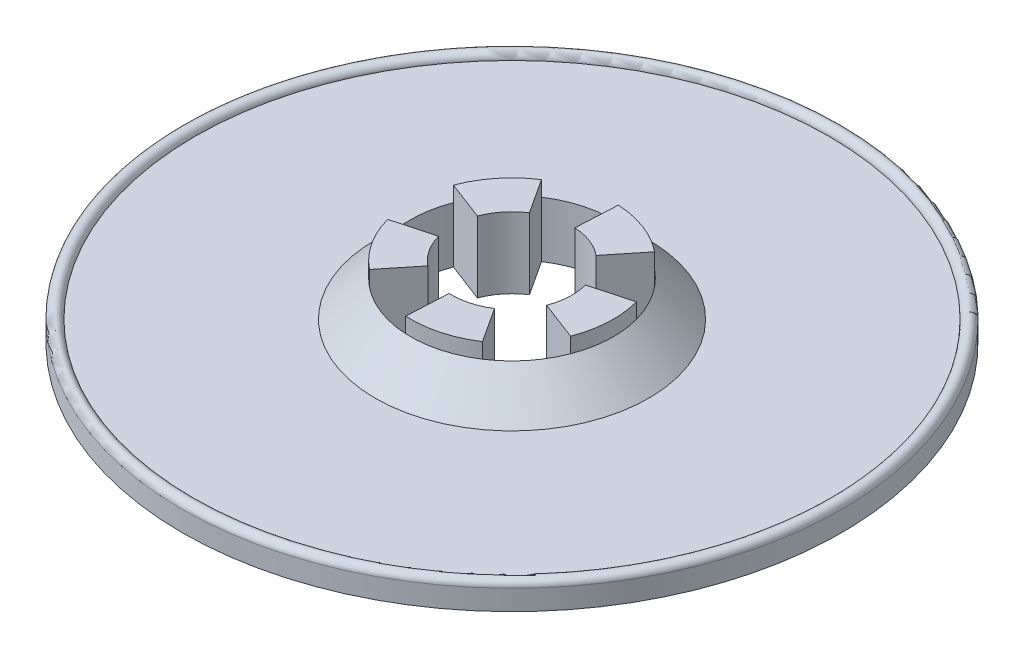
ISO-10303-21;
HEADER;
FILE_DESCRIPTION(('STEP AP214'),'2;1');
FILE_NAME('part.step','',(''),(''),'','','');
FILE_SCHEMA(('AUTOMOTIVE_DESIGN { 1 0 10303 214 1 1 1 1 }'));
ENDSEC;
DATA;
#1=APPLICATION_CONTEXT('core data for automotive mechanical design processes');
#2=APPLICATION_PROTOCOL_DEFINITION('international standard','automotive_design',2000,#1);
#3=PRODUCT_CONTEXT('',#1,'mechanical');
#4=PRODUCT('Part','Part','',(#3));
#5=PRODUCT_RELATED_PRODUCT_CATEGORY('part','',(#4));
#6=PRODUCT_DEFINITION_FORMATION('','',#4);
#7=PRODUCT_DEFINITION_CONTEXT('part definition',#1,'design');
#8=PRODUCT_DEFINITION('design','',#6,#7);
#9=PRODUCT_DEFINITION_SHAPE('','',#8);
#10=(LENGTH_UNIT() NAMED_UNIT(*) SI_UNIT(.MILLI.,.METRE.));
#11=(NAMED_UNIT(*) PLANE_ANGLE_UNIT() SI_UNIT($,.RADIAN.));
#12=(NAMED_UNIT(*) SI_UNIT($,.STERADIAN.) SOLID_ANGLE_UNIT());
#13=UNCERTAINTY_MEASURE_WITH_UNIT(LENGTH_MEASURE(1.E-05),#10,'distance_accuracy_value','');
#14=(GEOMETRIC_REPRESENTATION_CONTEXT(3) GLOBAL_UNCERTAINTY_ASSIGNED_CONTEXT((#13)) GLOBAL_UNIT_ASSIGNED_CONTEXT((#10,
#11,#12)) REPRESENTATION_CONTEXT('',''));
#15=CARTESIAN_POINT('',(0.,0.,0.));
#16=DIRECTION('',(0.,0.,1.));
#17=DIRECTION('',(1.,0.,0.));
#18=AXIS2_PLACEMENT_3D('',#15,#16,#17);
#19=CARTESIAN_POINT('',(0.,2.54,0.));
#20=DIRECTION('',(0.,1.,0.));
#21=DIRECTION('',(0.,0.,1.));
#22=AXIS2_PLACEMENT_3D('',#19,#20,#21);
#23=PLANE('',#22);
#24=CARTESIAN_POINT('',(0.,2.54,0.));
#25=DIRECTION('',(0.,1.,0.));
#26=DIRECTION('',(0.,0.,1.));
#27=AXIS2_PLACEMENT_3D('',#24,#25,#26);
#28=CIRCLE('',#27,17.145);
#29=CARTESIAN_POINT('',(0.,2.54,17.145));
#30=VERTEX_POINT('',#29);
#31=EDGE_CURVE('E52',#30,#30,#28,.F.);
#32=ORIENTED_EDGE('',*,*,#31,.T.);
#33=EDGE_LOOP('',(#32));
#34=FACE_BOUND('',#33,.T.);
#35=CARTESIAN_POINT('',(0.,2.54,0.));
#36=DIRECTION('',(0.,-1.,0.));
#37=DIRECTION('',(0.,0.,-1.));
#38=AXIS2_PLACEMENT_3D('',#35,#36,#37);
#39=CIRCLE('',#38,39.68496);
#40=CARTESIAN_POINT('',(0.,2.54,-39.68496));
#41=VERTEX_POINT('',#40);
#42=EDGE_CURVE('E11',#41,#41,#39,.T.);
#43=ORIENTED_EDGE('',*,*,#42,.F.);
#44=EDGE_LOOP('',(#43));
#45=FACE_BOUND('',#44,.T.);
#46=ADVANCED_FACE('F42',(#34,#45),#23,.T.);
#47=CARTESIAN_POINT('',(0.,8.89,0.));
#48=DIRECTION('',(0.,-1.,0.));
#49=DIRECTION('',(0.,0.,-1.));
#50=AXIS2_PLACEMENT_3D('',#47,#48,#49);
#51=CYLINDRICAL_SURFACE('',#50,12.7);
#52=DIRECTION('',(0.,-1.,0.));
#53=VECTOR('',#52,1.);
#54=CARTESIAN_POINT('',(-0.637603684295905,8.89,12.683984450549));
#55=LINE('',#54,#53);
#56=CARTESIAN_POINT('',(-0.637603684295905,8.89,12.683984450549));
#57=VERTEX_POINT('',#56);
#58=CARTESIAN_POINT('',(-0.637603684295905,6.98500000000022,12.683984450549));
#59=VERTEX_POINT('',#58);
#60=EDGE_CURVE('E391',#57,#59,#55,.T.);
#61=ORIENTED_EDGE('',*,*,#60,.T.);
#62=CARTESIAN_POINT('',(0.,6.98500000000003,0.));
#63=DIRECTION('',(0.,1.,0.));
#64=DIRECTION('',(0.,0.,1.));
#65=AXIS2_PLACEMENT_3D('',#62,#63,#64);
#66=CIRCLE('',#65,12.7);
#67=CARTESIAN_POINT('',(6.93962678406843,6.98499999999977,10.6363330193185));
#68=VERTEX_POINT('',#67);
#69=EDGE_CURVE('E468',#59,#68,#66,.T.);
#70=ORIENTED_EDGE('',*,*,#69,.T.);
#71=DIRECTION('',(0.,-1.,0.));
#72=VECTOR('',#71,1.);
#73=CARTESIAN_POINT('',(6.93962678406843,8.89,10.6363330193185));
#74=LINE('',#73,#72);
#75=CARTESIAN_POINT('',(6.93962678406843,8.89,10.6363330193185));
#76=VERTEX_POINT('',#75);
#77=EDGE_CURVE('E402',#76,#68,#74,.T.);
#78=ORIENTED_EDGE('',*,*,#77,.F.);
#79=CARTESIAN_POINT('',(0.,8.89,0.));
#80=DIRECTION('',(0.,1.,0.));
#81=DIRECTION('',(0.,0.,1.));
#82=AXIS2_PLACEMENT_3D('',#79,#80,#81);
#83=CIRCLE('',#82,12.7);
#84=EDGE_CURVE('E389',#57,#76,#83,.T.);
#85=ORIENTED_EDGE('',*,*,#84,.F.);
#86=EDGE_LOOP('',(#61,#70,#78,#85));
#87=FACE_BOUND('',#86,.T.);
#88=ADVANCED_FACE('F599',(#87),#51,.T.);
#89=DIRECTION('',(0.,-1.,0.));
#90=VECTOR('',#89,1.);
#91=CARTESIAN_POINT('',(11.8661556901579,8.89,4.5259638903708));
#92=LINE('',#91,#90);
#93=CARTESIAN_POINT('',(11.8661556901579,8.89,4.5259638903708));
#94=VERTEX_POINT('',#93);
#95=CARTESIAN_POINT('',(11.8661556901579,6.98499999999977,4.5259638903708));
#96=VERTEX_POINT('',#95);
#97=EDGE_CURVE('E407',#94,#96,#92,.T.);
#98=ORIENTED_EDGE('',*,*,#97,.T.);
#99=CARTESIAN_POINT('',(12.2602164384049,6.98499999999977,-3.31316961284385));
#100=VERTEX_POINT('',#99);
#101=EDGE_CURVE('E475',#96,#100,#66,.T.);
#102=ORIENTED_EDGE('',*,*,#101,.T.);
#103=DIRECTION('',(0.,-1.,0.));
#104=VECTOR('',#103,1.);
#105=CARTESIAN_POINT('',(12.2602164384049,8.89,-3.31316961284385));
#106=LINE('',#105,#104);
#107=CARTESIAN_POINT('',(12.2602164384049,8.89,-3.31316961284385));
#108=VERTEX_POINT('',#107);
#109=EDGE_CURVE('E418',#108,#100,#106,.T.);
#110=ORIENTED_EDGE('',*,*,#109,.F.);
#111=EDGE_CURVE('E463',#94,#108,#83,.T.);
#112=ORIENTED_EDGE('',*,*,#111,.F.);
#113=EDGE_LOOP('',(#98,#102,#110,#112));
#114=FACE_BOUND('',#113,.T.);
#115=ADVANCED_FACE('F503',(#114),#51,.T.);
#116=DIRECTION('',(0.,-1.,0.));
#117=VECTOR('',#116,1.);
#118=CARTESIAN_POINT('',(7.97129121661164,8.89,-9.88678493444575));
#119=LINE('',#118,#117);
#120=CARTESIAN_POINT('',(7.97129121661164,8.89,-9.88678493444575));
#121=VERTEX_POINT('',#120);
#122=CARTESIAN_POINT('',(7.97129121661164,6.98499999999977,-9.88678493444575));
#123=VERTEX_POINT('',#122);
#124=EDGE_CURVE('E423',#121,#123,#119,.T.);
#125=ORIENTED_EDGE('',*,*,#124,.T.);
#126=CARTESIAN_POINT('',(0.637603684295973,6.98499999999994,-12.6839844505495));
#127=VERTEX_POINT('',#126);
#128=EDGE_CURVE('E539',#123,#127,#66,.T.);
#129=ORIENTED_EDGE('',*,*,#128,.T.);
#130=DIRECTION('',(0.,-1.,0.));
#131=VECTOR('',#130,1.);
#132=CARTESIAN_POINT('',(0.637603684295973,8.89,-12.6839844505495));
#133=LINE('',#132,#131);
#134=CARTESIAN_POINT('',(0.637603684295973,8.89,-12.6839844505495));
#135=VERTEX_POINT('',#134);
#136=EDGE_CURVE('E434',#135,#127,#133,.T.);
#137=ORIENTED_EDGE('',*,*,#136,.F.);
#138=EDGE_CURVE('E508',#121,#135,#83,.T.);
#139=ORIENTED_EDGE('',*,*,#138,.F.);
#140=EDGE_LOOP('',(#125,#129,#137,#139));
#141=FACE_BOUND('',#140,.T.);
#142=ADVANCED_FACE('F750',(#141),#51,.T.);
#143=DIRECTION('',(0.,-1.,0.));
#144=VECTOR('',#143,1.);
#145=CARTESIAN_POINT('',(-6.93962678406824,8.89,-10.6363330193181));
#146=LINE('',#145,#144);
#147=CARTESIAN_POINT('',(-6.93962678406824,8.89,-10.6363330193181));
#148=VERTEX_POINT('',#147);
#149=CARTESIAN_POINT('',(-6.93962678406824,6.98499999999994,-10.6363330193181));
#150=VERTEX_POINT('',#149);
#151=EDGE_CURVE('E439',#148,#150,#146,.T.);
#152=ORIENTED_EDGE('',*,*,#151,.T.);
#153=CARTESIAN_POINT('',(-11.8661556901576,6.98500000000003,-4.52596389037074));
#154=VERTEX_POINT('',#153);
#155=EDGE_CURVE('E529',#150,#154,#66,.T.);
#156=ORIENTED_EDGE('',*,*,#155,.T.);
#157=DIRECTION('',(0.,-1.,0.));
#158=VECTOR('',#157,1.);
#159=CARTESIAN_POINT('',(-11.8661556901576,8.89,-4.52596389037074));
#160=LINE('',#159,#158);
#161=CARTESIAN_POINT('',(-11.8661556901576,8.89,-4.52596389037074));
#162=VERTEX_POINT('',#161);
#163=EDGE_CURVE('E73',#162,#154,#160,.T.);
#164=ORIENTED_EDGE('',*,*,#163,.F.);
#165=EDGE_CURVE('E511',#148,#162,#83,.T.);
#166=ORIENTED_EDGE('',*,*,#165,.F.);
#167=EDGE_LOOP('',(#152,#156,#164,#166));
#168=FACE_BOUND('',#167,.T.);
#169=ADVANCED_FACE('F620',(#168),#51,.T.);
#170=CARTESIAN_POINT('',(0.,8.89,0.));
#171=DIRECTION('',(0.,1.,0.));
#172=DIRECTION('',(0.,0.,1.));
#173=AXIS2_PLACEMENT_3D('',#170,#171,#172);
#174=PLANE('',#173);
#175=CARTESIAN_POINT('',(0.,8.89,0.));
#176=DIRECTION('',(0.,-1.,0.));
#177=DIRECTION('',(0.,0.,-1.));
#178=AXIS2_PLACEMENT_3D('',#175,#176,#177);
#179=CIRCLE('',#178,7.49999999999986);
#180=CARTESIAN_POINT('',(4.09820479374102,8.89,6.28129902715633));
#181=VERTEX_POINT('',#180);
#182=CARTESIAN_POINT('',(-0.37653760883616,8.89,7.49054199835562));
#183=VERTEX_POINT('',#182);
#184=EDGE_CURVE('E281',#181,#183,#179,.T.);
#185=ORIENTED_EDGE('',*,*,#184,.T.);
#186=DIRECTION('',(0.0502050145114891,0.,-0.998738933114105));
#187=VECTOR('',#186,1.);
#188=CARTESIAN_POINT('',(0.,8.89,0.));
#189=LINE('',#188,#187);
#190=EDGE_CURVE('E270',#57,#183,#189,.T.);
#191=ORIENTED_EDGE('',*,*,#190,.F.);
#192=ORIENTED_EDGE('',*,*,#84,.T.);
#193=DIRECTION('',(-0.546427305832151,0.,-0.8375065369542));
#194=VECTOR('',#193,1.);
#195=CARTESIAN_POINT('',(0.,8.89,0.));
#196=LINE('',#195,#194);
#197=EDGE_CURVE('E320',#76,#181,#196,.T.);
#198=ORIENTED_EDGE('',*,*,#197,.T.);
#199=EDGE_LOOP('',(#185,#191,#192,#198));
#200=FACE_BOUND('',#199,.T.);
#201=ADVANCED_FACE('F596',(#200),#174,.T.);
#202=CARTESIAN_POINT('',(7.24028529827031,8.89,-1.95659622805731));
#203=VERTEX_POINT('',#202);
#204=CARTESIAN_POINT('',(7.00757225796699,8.89,2.67281332108501));
#205=VERTEX_POINT('',#204);
#206=EDGE_CURVE('E316',#203,#205,#179,.T.);
#207=ORIENTED_EDGE('',*,*,#206,.T.);
#208=DIRECTION('',(-0.934342967728948,0.,-0.356375109478007));
#209=VECTOR('',#208,1.);
#210=CARTESIAN_POINT('',(0.,8.89,0.));
#211=LINE('',#210,#209);
#212=EDGE_CURVE('E317',#94,#205,#211,.T.);
#213=ORIENTED_EDGE('',*,*,#212,.F.);
#214=ORIENTED_EDGE('',*,*,#111,.T.);
#215=DIRECTION('',(-0.965371373102731,0.,0.260879497074314));
#216=VECTOR('',#215,1.);
#217=CARTESIAN_POINT('',(0.,8.89,0.));
#218=LINE('',#217,#216);
#219=EDGE_CURVE('E312',#108,#203,#218,.T.);
#220=ORIENTED_EDGE('',*,*,#219,.T.);
#221=EDGE_LOOP('',(#207,#213,#214,#220));
#222=FACE_BOUND('',#221,.T.);
#223=ADVANCED_FACE('F766',(#222),#174,.T.);
#224=CARTESIAN_POINT('',(0.37653760883619,8.89,-7.49054199835569));
#225=VERTEX_POINT('',#224);
#226=CARTESIAN_POINT('',(4.7074554428807,8.89,-5.83865252034175));
#227=VERTEX_POINT('',#226);
#228=EDGE_CURVE('E308',#225,#227,#179,.T.);
#229=ORIENTED_EDGE('',*,*,#228,.T.);
#230=DIRECTION('',(-0.627660725717426,0.,0.778487002712232));
#231=VECTOR('',#230,1.);
#232=CARTESIAN_POINT('',(0.,8.89,0.));
#233=LINE('',#232,#231);
#234=EDGE_CURVE('E309',#121,#227,#233,.T.);
#235=ORIENTED_EDGE('',*,*,#234,.F.);
#236=ORIENTED_EDGE('',*,*,#138,.T.);
#237=DIRECTION('',(-0.0502050145114927,0.,0.998738933114105));
#238=VECTOR('',#237,1.);
#239=CARTESIAN_POINT('',(0.,8.89,0.));
#240=LINE('',#239,#238);
#241=EDGE_CURVE('E304',#135,#225,#240,.T.);
#242=ORIENTED_EDGE('',*,*,#241,.T.);
#243=EDGE_LOOP('',(#229,#235,#236,#242));
#244=FACE_BOUND('',#243,.T.);
#245=ADVANCED_FACE('F657',(#244),#174,.T.);
#246=CARTESIAN_POINT('',(-7.00757225796704,8.89,-2.67281332108506));
#247=VERTEX_POINT('',#246);
#248=CARTESIAN_POINT('',(-4.09820479374107,8.89,-6.28129902715634));
#249=VERTEX_POINT('',#248);
#250=EDGE_CURVE('E282',#247,#249,#179,.T.);
#251=ORIENTED_EDGE('',*,*,#250,.T.);
#252=DIRECTION('',(0.546427305832155,0.,0.837506536954198));
#253=VECTOR('',#252,1.);
#254=CARTESIAN_POINT('',(0.,8.89,0.));
#255=LINE('',#254,#253);
#256=EDGE_CURVE('E301',#148,#249,#255,.T.);
#257=ORIENTED_EDGE('',*,*,#256,.F.);
#258=ORIENTED_EDGE('',*,*,#165,.T.);
#259=DIRECTION('',(0.934342967728947,0.,0.356375109478011));
#260=VECTOR('',#259,1.);
#261=CARTESIAN_POINT('',(0.,8.89,0.));
#262=LINE('',#261,#260);
#263=EDGE_CURVE('E297',#162,#247,#262,.T.);
#264=ORIENTED_EDGE('',*,*,#263,.T.);
#265=EDGE_LOOP('',(#251,#257,#258,#264));
#266=FACE_BOUND('',#265,.T.);
#267=ADVANCED_FACE('F613',(#266),#174,.T.);
#268=CARTESIAN_POINT('',(0.,2.54,0.));
#269=DIRECTION('',(0.,-1.,0.));
#270=DIRECTION('',(0.,0.,-1.));
#271=AXIS2_PLACEMENT_3D('',#268,#269,#270);
#272=CYLINDRICAL_SURFACE('',#271,41.275);
#273=CARTESIAN_POINT('',(0.,2.54,0.));
#274=DIRECTION('',(0.,1.,0.));
#275=DIRECTION('',(0.,0.,1.));
#276=AXIS2_PLACEMENT_3D('',#273,#274,#275);
#277=CIRCLE('',#276,41.275);
#278=CARTESIAN_POINT('',(0.,2.54,41.275));
#279=VERTEX_POINT('',#278);
#280=EDGE_CURVE('E464',#279,#279,#277,.T.);
#281=ORIENTED_EDGE('',*,*,#280,.F.);
#282=EDGE_LOOP('',(#281));
#283=FACE_BOUND('',#282,.T.);
#284=CARTESIAN_POINT('',(0.,0.,0.));
#285=DIRECTION('',(0.,1.,0.));
#286=DIRECTION('',(0.,0.,1.));
#287=AXIS2_PLACEMENT_3D('',#284,#285,#286);
#288=CIRCLE('',#287,41.275);
#289=CARTESIAN_POINT('',(0.,0.,41.275));
#290=VERTEX_POINT('',#289);
#291=EDGE_CURVE('E469',#290,#290,#288,.T.);
#292=ORIENTED_EDGE('',*,*,#291,.T.);
#293=EDGE_LOOP('',(#292));
#294=FACE_BOUND('',#293,.T.);
#295=ADVANCED_FACE('F651',(#283,#294),#272,.T.);
#296=CARTESIAN_POINT('',(0.,0.,0.));
#297=DIRECTION('',(0.,1.,0.));
#298=DIRECTION('',(0.,0.,1.));
#299=AXIS2_PLACEMENT_3D('',#296,#297,#298);
#300=PLANE('',#299);
#301=CARTESIAN_POINT('',(0.,0.,0.));
#302=DIRECTION('',(0.,-1.,0.));
#303=DIRECTION('',(0.,0.,-1.));
#304=AXIS2_PLACEMENT_3D('',#301,#302,#303);
#305=CIRCLE('',#304,7.49999999999986);
#306=CARTESIAN_POINT('',(-4.70745544288062,0.,5.83865252034161));
#307=VERTEX_POINT('',#306);
#308=CARTESIAN_POINT('',(-7.24028529827035,0.,1.95659622805735));
#309=VERTEX_POINT('',#308);
#310=EDGE_CURVE('E328',#307,#309,#305,.T.);
#311=ORIENTED_EDGE('',*,*,#310,.F.);
#312=DIRECTION('',(0.627660725717428,0.,-0.77848700271223));
#313=VECTOR('',#312,1.);
#314=CARTESIAN_POINT('',(0.,0.,0.));
#315=LINE('',#314,#313);
#316=CARTESIAN_POINT('',(-7.97129121661116,0.,9.88678493444511));
#317=VERTEX_POINT('',#316);
#318=EDGE_CURVE('E62',#317,#307,#315,.T.);
#319=ORIENTED_EDGE('',*,*,#318,.F.);
#320=CARTESIAN_POINT('',(0.,0.,0.));
#321=DIRECTION('',(0.,-1.,0.));
#322=DIRECTION('',(0.,0.,-1.));
#323=AXIS2_PLACEMENT_3D('',#320,#321,#322);
#324=CIRCLE('',#323,12.6999999999998);
#325=CARTESIAN_POINT('',(-0.637603684295905,0.,12.683984450549));
#326=VERTEX_POINT('',#325);
#327=EDGE_CURVE('E288',#326,#317,#324,.T.);
#328=ORIENTED_EDGE('',*,*,#327,.F.);
#329=DIRECTION('',(0.0502050145114891,0.,-0.998738933114105));
#330=VECTOR('',#329,1.);
#331=CARTESIAN_POINT('',(0.,0.,0.));
#332=LINE('',#331,#330);
#333=CARTESIAN_POINT('',(-0.37653760883616,0.,7.49054199835562));
#334=VERTEX_POINT('',#333);
#335=EDGE_CURVE('E292',#326,#334,#332,.T.);
#336=ORIENTED_EDGE('',*,*,#335,.T.);
#337=CARTESIAN_POINT('',(4.09820479374102,0.,6.28129902715633));
#338=VERTEX_POINT('',#337);
#339=EDGE_CURVE('E332',#338,#334,#305,.T.);
#340=ORIENTED_EDGE('',*,*,#339,.F.);
#341=DIRECTION('',(-0.546427305832151,0.,-0.8375065369542));
#342=VECTOR('',#341,1.);
#343=CARTESIAN_POINT('',(0.,0.,0.));
#344=LINE('',#343,#342);
#345=CARTESIAN_POINT('',(6.93962678406843,0.,10.6363330193185));
#346=VERTEX_POINT('',#345);
#347=EDGE_CURVE('E379',#346,#338,#344,.T.);
#348=ORIENTED_EDGE('',*,*,#347,.F.);
#349=CARTESIAN_POINT('',(0.,0.,0.));
#350=DIRECTION('',(0.,-1.,0.));
#351=DIRECTION('',(0.,0.,-1.));
#352=AXIS2_PLACEMENT_3D('',#349,#350,#351);
#353=CIRCLE('',#352,12.7000000000003);
#354=CARTESIAN_POINT('',(11.8661556901579,0.,4.5259638903708));
#355=VERTEX_POINT('',#354);
#356=EDGE_CURVE('E375',#355,#346,#353,.T.);
#357=ORIENTED_EDGE('',*,*,#356,.F.);
#358=DIRECTION('',(-0.934342967728948,0.,-0.356375109478007));
#359=VECTOR('',#358,1.);
#360=CARTESIAN_POINT('',(0.,0.,0.));
#361=LINE('',#360,#359);
#362=CARTESIAN_POINT('',(7.00757225796699,0.,2.67281332108501));
#363=VERTEX_POINT('',#362);
#364=EDGE_CURVE('E371',#355,#363,#361,.T.);
#365=ORIENTED_EDGE('',*,*,#364,.T.);
#366=CARTESIAN_POINT('',(7.24028529827031,0.,-1.95659622805731));
#367=VERTEX_POINT('',#366);
#368=EDGE_CURVE('E370',#367,#363,#305,.T.);
#369=ORIENTED_EDGE('',*,*,#368,.F.);
#370=DIRECTION('',(-0.965371373102731,0.,0.260879497074314));
#371=VECTOR('',#370,1.);
#372=CARTESIAN_POINT('',(0.,0.,0.));
#373=LINE('',#372,#371);
#374=CARTESIAN_POINT('',(12.2602164384049,0.,-3.31316961284385));
#375=VERTEX_POINT('',#374);
#376=EDGE_CURVE('E366',#375,#367,#373,.T.);
#377=ORIENTED_EDGE('',*,*,#376,.F.);
#378=CARTESIAN_POINT('',(0.,0.,0.));
#379=DIRECTION('',(0.,-1.,0.));
#380=DIRECTION('',(0.,0.,-1.));
#381=AXIS2_PLACEMENT_3D('',#378,#379,#380);
#382=CIRCLE('',#381,12.7000000000003);
#383=CARTESIAN_POINT('',(7.97129121661164,0.,-9.88678493444575));
#384=VERTEX_POINT('',#383);
#385=EDGE_CURVE('E362',#384,#375,#382,.T.);
#386=ORIENTED_EDGE('',*,*,#385,.F.);
#387=DIRECTION('',(-0.627660725717426,0.,0.778487002712232));
#388=VECTOR('',#387,1.);
#389=CARTESIAN_POINT('',(0.,0.,0.));
#390=LINE('',#389,#388);
#391=CARTESIAN_POINT('',(4.7074554428807,0.,-5.83865252034175));
#392=VERTEX_POINT('',#391);
#393=EDGE_CURVE('E358',#384,#392,#390,.T.);
#394=ORIENTED_EDGE('',*,*,#393,.T.);
#395=CARTESIAN_POINT('',(0.37653760883619,0.,-7.49054199835569));
#396=VERTEX_POINT('',#395);
#397=EDGE_CURVE('E357',#396,#392,#305,.T.);
#398=ORIENTED_EDGE('',*,*,#397,.F.);
#399=DIRECTION('',(-0.0502050145114927,0.,0.998738933114105));
#400=VECTOR('',#399,1.);
#401=CARTESIAN_POINT('',(0.,0.,0.));
#402=LINE('',#401,#400);
#403=CARTESIAN_POINT('',(0.637603684295973,0.,-12.6839844505495));
#404=VERTEX_POINT('',#403);
#405=EDGE_CURVE('E353',#404,#396,#402,.T.);
#406=ORIENTED_EDGE('',*,*,#405,.F.);
#407=CARTESIAN_POINT('',(0.,0.,0.));
#408=DIRECTION('',(0.,-1.,0.));
#409=DIRECTION('',(0.,0.,-1.));
#410=AXIS2_PLACEMENT_3D('',#407,#408,#409);
#411=CIRCLE('',#410,12.7000000000001);
#412=CARTESIAN_POINT('',(-6.93962678406824,0.,-10.6363330193181));
#413=VERTEX_POINT('',#412);
#414=EDGE_CURVE('E349',#413,#404,#411,.T.);
#415=ORIENTED_EDGE('',*,*,#414,.F.);
#416=DIRECTION('',(0.546427305832155,0.,0.837506536954198));
#417=VECTOR('',#416,1.);
#418=CARTESIAN_POINT('',(0.,0.,0.));
#419=LINE('',#418,#417);
#420=CARTESIAN_POINT('',(-4.09820479374107,0.,-6.28129902715634));
#421=VERTEX_POINT('',#420);
#422=EDGE_CURVE('E345',#413,#421,#419,.T.);
#423=ORIENTED_EDGE('',*,*,#422,.T.);
#424=CARTESIAN_POINT('',(-7.00757225796704,0.,-2.67281332108506));
#425=VERTEX_POINT('',#424);
#426=EDGE_CURVE('E333',#425,#421,#305,.T.);
#427=ORIENTED_EDGE('',*,*,#426,.F.);
#428=DIRECTION('',(0.934342967728947,0.,0.356375109478011));
#429=VECTOR('',#428,1.);
#430=CARTESIAN_POINT('',(0.,0.,0.));
#431=LINE('',#430,#429);
#432=CARTESIAN_POINT('',(-11.8661556901576,0.,-4.52596389037074));
#433=VERTEX_POINT('',#432);
#434=EDGE_CURVE('E341',#433,#425,#431,.T.);
#435=ORIENTED_EDGE('',*,*,#434,.F.);
#436=CARTESIAN_POINT('',(0.,0.,0.));
#437=DIRECTION('',(0.,-1.,0.));
#438=DIRECTION('',(0.,0.,-1.));
#439=AXIS2_PLACEMENT_3D('',#436,#437,#438);
#440=CIRCLE('',#439,12.6999999999999);
#441=CARTESIAN_POINT('',(-12.2602164384045,0.,3.3131696128438));
#442=VERTEX_POINT('',#441);
#443=EDGE_CURVE('E337',#442,#433,#440,.T.);
#444=ORIENTED_EDGE('',*,*,#443,.F.);
#445=DIRECTION('',(0.96537137310273,0.,-0.260879497074318));
#446=VECTOR('',#445,1.);
#447=CARTESIAN_POINT('',(0.,0.,0.));
#448=LINE('',#447,#446);
#449=EDGE_CURVE('E331',#442,#309,#448,.T.);
#450=ORIENTED_EDGE('',*,*,#449,.T.);
#451=EDGE_LOOP('',(#311,#319,#328,#336,#340,#348,#357,#365,#369,#377,#386,#394,#398,#406,#415,
#423,#427,#435,#444,#450));
#452=FACE_BOUND('',#451,.T.);
#453=ORIENTED_EDGE('',*,*,#291,.F.);
#454=EDGE_LOOP('',(#453));
#455=FACE_BOUND('',#454,.T.);
#456=ADVANCED_FACE('F563',(#452,#455),#300,.F.);
#457=CARTESIAN_POINT('',(-12.2602164384045,6.98500000000012,3.3131696128438));
#458=VERTEX_POINT('',#457);
#459=CARTESIAN_POINT('',(-7.97129121661116,6.98500000000022,9.88678493444511));
#460=VERTEX_POINT('',#459);
#461=EDGE_CURVE('E523',#458,#460,#66,.T.);
#462=ORIENTED_EDGE('',*,*,#461,.T.);
#463=DIRECTION('',(0.,-1.,0.));
#464=VECTOR('',#463,1.);
#465=CARTESIAN_POINT('',(-7.97129121661116,8.89,9.88678493444511));
#466=LINE('',#465,#464);
#467=CARTESIAN_POINT('',(-7.97129121661116,8.89,9.88678493444511));
#468=VERTEX_POINT('',#467);
#469=EDGE_CURVE('E386',#468,#460,#466,.T.);
#470=ORIENTED_EDGE('',*,*,#469,.F.);
#471=CARTESIAN_POINT('',(-12.2602164384045,8.89,3.3131696128438));
#472=VERTEX_POINT('',#471);
#473=EDGE_CURVE('E286',#472,#468,#83,.T.);
#474=ORIENTED_EDGE('',*,*,#473,.F.);
#475=DIRECTION('',(0.,-1.,0.));
#476=VECTOR('',#475,1.);
#477=CARTESIAN_POINT('',(-12.2602164384045,8.89,3.3131696128438));
#478=LINE('',#477,#476);
#479=EDGE_CURVE('E453',#472,#458,#478,.T.);
#480=ORIENTED_EDGE('',*,*,#479,.T.);
#481=EDGE_LOOP('',(#462,#470,#474,#480));
#482=FACE_BOUND('',#481,.T.);
#483=ADVANCED_FACE('F623',(#482),#51,.T.);
#484=DIRECTION('',(0.627660725717428,0.,-0.77848700271223));
#485=VECTOR('',#484,1.);
#486=CARTESIAN_POINT('',(0.,8.89,0.));
#487=LINE('',#486,#485);
#488=CARTESIAN_POINT('',(-4.70745544288062,8.89,5.83865252034162));
#489=VERTEX_POINT('',#488);
#490=EDGE_CURVE('E263',#468,#489,#487,.T.);
#491=ORIENTED_EDGE('',*,*,#490,.T.);
#492=CARTESIAN_POINT('',(-7.24028529827035,8.89,1.95659622805735));
#493=VERTEX_POINT('',#492);
#494=EDGE_CURVE('E274',#489,#493,#179,.T.);
#495=ORIENTED_EDGE('',*,*,#494,.T.);
#496=DIRECTION('',(0.96537137310273,0.,-0.260879497074318));
#497=VECTOR('',#496,1.);
#498=CARTESIAN_POINT('',(0.,8.89,0.));
#499=LINE('',#498,#497);
#500=EDGE_CURVE('E279',#472,#493,#499,.T.);
#501=ORIENTED_EDGE('',*,*,#500,.F.);
#502=ORIENTED_EDGE('',*,*,#473,.T.);
#503=EDGE_LOOP('',(#491,#495,#501,#502));
#504=FACE_BOUND('',#503,.T.);
#505=ADVANCED_FACE('F284',(#504),#174,.T.);
#506=CARTESIAN_POINT('',(0.,6.98500000000003,0.));
#507=DIRECTION('',(0.,-1.,0.));
#508=DIRECTION('',(0.,0.,-1.));
#509=AXIS2_PLACEMENT_3D('',#506,#507,#508);
#510=CONICAL_SURFACE('',#509,12.7,0.785398163397443);
#511=ORIENTED_EDGE('',*,*,#31,.F.);
#512=EDGE_LOOP('',(#511));
#513=FACE_BOUND('',#512,.T.);
#514=EDGE_CURVE('E473',#68,#96,#66,.T.);
#515=ORIENTED_EDGE('',*,*,#514,.F.);
#516=ORIENTED_EDGE('',*,*,#69,.F.);
#517=EDGE_CURVE('E526',#460,#59,#66,.T.);
#518=ORIENTED_EDGE('',*,*,#517,.F.);
#519=ORIENTED_EDGE('',*,*,#461,.F.);
#520=EDGE_CURVE('E525',#154,#458,#66,.T.);
#521=ORIENTED_EDGE('',*,*,#520,.F.);
#522=ORIENTED_EDGE('',*,*,#155,.F.);
#523=EDGE_CURVE('E535',#127,#150,#66,.T.);
#524=ORIENTED_EDGE('',*,*,#523,.F.);
#525=ORIENTED_EDGE('',*,*,#128,.F.);
#526=EDGE_CURVE('E546',#100,#123,#66,.T.);
#527=ORIENTED_EDGE('',*,*,#526,.F.);
#528=ORIENTED_EDGE('',*,*,#101,.F.);
#529=EDGE_LOOP('',(#515,#516,#518,#519,#521,#522,#524,#525,#527,#528));
#530=FACE_BOUND('',#529,.T.);
#531=ADVANCED_FACE('F45',(#513,#530),#510,.T.);
#532=CARTESIAN_POINT('',(0.,8.89,0.));
#533=DIRECTION('',(0.,-1.,0.));
#534=DIRECTION('',(0.,0.,-1.));
#535=AXIS2_PLACEMENT_3D('',#532,#533,#534);
#536=CYLINDRICAL_SURFACE('',#535,12.6999999999998);
#537=EDGE_CURVE('E395',#59,#326,#55,.T.);
#538=ORIENTED_EDGE('',*,*,#537,.T.);
#539=ORIENTED_EDGE('',*,*,#327,.T.);
#540=EDGE_CURVE('E390',#460,#317,#466,.T.);
#541=ORIENTED_EDGE('',*,*,#540,.F.);
#542=ORIENTED_EDGE('',*,*,#517,.T.);
#543=EDGE_LOOP('',(#538,#539,#541,#542));
#544=FACE_BOUND('',#543,.T.);
#545=ADVANCED_FACE('F484',(#544),#536,.F.);
#546=CARTESIAN_POINT('',(0.,8.89,0.));
#547=DIRECTION('',(0.,-1.,0.));
#548=DIRECTION('',(0.,0.,-1.));
#549=AXIS2_PLACEMENT_3D('',#546,#547,#548);
#550=CYLINDRICAL_SURFACE('',#549,12.7000000000003);
#551=EDGE_CURVE('E411',#96,#355,#92,.T.);
#552=ORIENTED_EDGE('',*,*,#551,.T.);
#553=ORIENTED_EDGE('',*,*,#356,.T.);
#554=EDGE_CURVE('E406',#68,#346,#74,.T.);
#555=ORIENTED_EDGE('',*,*,#554,.F.);
#556=ORIENTED_EDGE('',*,*,#514,.T.);
#557=EDGE_LOOP('',(#552,#553,#555,#556));
#558=FACE_BOUND('',#557,.T.);
#559=ADVANCED_FACE('F494',(#558),#550,.F.);
#560=CARTESIAN_POINT('',(0.,8.89,0.));
#561=DIRECTION('',(0.,-1.,0.));
#562=DIRECTION('',(0.,0.,-1.));
#563=AXIS2_PLACEMENT_3D('',#560,#561,#562);
#564=CYLINDRICAL_SURFACE('',#563,12.7000000000003);
#565=EDGE_CURVE('E427',#123,#384,#119,.T.);
#566=ORIENTED_EDGE('',*,*,#565,.T.);
#567=ORIENTED_EDGE('',*,*,#385,.T.);
#568=EDGE_CURVE('E422',#100,#375,#106,.T.);
#569=ORIENTED_EDGE('',*,*,#568,.F.);
#570=ORIENTED_EDGE('',*,*,#526,.T.);
#571=EDGE_LOOP('',(#566,#567,#569,#570));
#572=FACE_BOUND('',#571,.T.);
#573=ADVANCED_FACE('F682',(#572),#564,.F.);
#574=CARTESIAN_POINT('',(0.,8.89,0.));
#575=DIRECTION('',(0.,-1.,0.));
#576=DIRECTION('',(0.,0.,-1.));
#577=AXIS2_PLACEMENT_3D('',#574,#575,#576);
#578=CYLINDRICAL_SURFACE('',#577,12.7000000000001);
#579=EDGE_CURVE('E443',#150,#413,#146,.T.);
#580=ORIENTED_EDGE('',*,*,#579,.T.);
#581=ORIENTED_EDGE('',*,*,#414,.T.);
#582=EDGE_CURVE('E438',#127,#404,#133,.T.);
#583=ORIENTED_EDGE('',*,*,#582,.F.);
#584=ORIENTED_EDGE('',*,*,#523,.T.);
#585=EDGE_LOOP('',(#580,#581,#583,#584));
#586=FACE_BOUND('',#585,.T.);
#587=ADVANCED_FACE('F560',(#586),#578,.F.);
#588=CARTESIAN_POINT('',(0.,8.89,0.));
#589=DIRECTION('',(0.,-1.,0.));
#590=DIRECTION('',(0.,0.,-1.));
#591=AXIS2_PLACEMENT_3D('',#588,#589,#590);
#592=CYLINDRICAL_SURFACE('',#591,12.6999999999999);
#593=EDGE_CURVE('E457',#458,#442,#478,.T.);
#594=ORIENTED_EDGE('',*,*,#593,.T.);
#595=ORIENTED_EDGE('',*,*,#443,.T.);
#596=EDGE_CURVE('E452',#154,#433,#160,.T.);
#597=ORIENTED_EDGE('',*,*,#596,.F.);
#598=ORIENTED_EDGE('',*,*,#520,.T.);
#599=EDGE_LOOP('',(#594,#595,#597,#598));
#600=FACE_BOUND('',#599,.T.);
#601=ADVANCED_FACE('F628',(#600),#592,.F.);
#602=CARTESIAN_POINT('',(0.,8.89,0.));
#603=DIRECTION('',(-0.77848700271223,0.,-0.627660725717428));
#604=DIRECTION('',(-0.627660725717428,0.,0.77848700271223));
#605=AXIS2_PLACEMENT_3D('',#602,#603,#604);
#606=PLANE('',#605);
#607=ORIENTED_EDGE('',*,*,#318,.T.);
#608=DIRECTION('',(0.,-1.,0.));
#609=VECTOR('',#608,1.);
#610=CARTESIAN_POINT('',(-4.70745544288062,8.89,5.83865252034162));
#611=LINE('',#610,#609);
#612=EDGE_CURVE('E258',#489,#307,#611,.T.);
#613=ORIENTED_EDGE('',*,*,#612,.F.);
#614=ORIENTED_EDGE('',*,*,#490,.F.);
#615=ORIENTED_EDGE('',*,*,#469,.T.);
#616=ORIENTED_EDGE('',*,*,#540,.T.);
#617=EDGE_LOOP('',(#607,#613,#614,#615,#616));
#618=FACE_BOUND('',#617,.T.);
#619=ADVANCED_FACE('F260',(#618),#606,.F.);
#620=CARTESIAN_POINT('',(0.,8.89,0.));
#621=DIRECTION('',(-0.998738933114105,0.,-0.0502050145114891));
#622=DIRECTION('',(-0.0502050145114891,0.,0.998738933114105));
#623=AXIS2_PLACEMENT_3D('',#620,#621,#622);
#624=PLANE('',#623);
#625=ORIENTED_EDGE('',*,*,#335,.F.);
#626=ORIENTED_EDGE('',*,*,#537,.F.);
#627=ORIENTED_EDGE('',*,*,#60,.F.);
#628=ORIENTED_EDGE('',*,*,#190,.T.);
#629=DIRECTION('',(0.,-1.,0.));
#630=VECTOR('',#629,1.);
#631=CARTESIAN_POINT('',(-0.37653760883616,8.89,7.49054199835562));
#632=LINE('',#631,#630);
#633=EDGE_CURVE('E396',#183,#334,#632,.T.);
#634=ORIENTED_EDGE('',*,*,#633,.T.);
#635=EDGE_LOOP('',(#625,#626,#627,#628,#634));
#636=FACE_BOUND('',#635,.T.);
#637=ADVANCED_FACE('F592',(#636),#624,.T.);
#638=CARTESIAN_POINT('',(0.,8.89,0.));
#639=DIRECTION('',(0.,-1.,0.));
#640=DIRECTION('',(0.,0.,-1.));
#641=AXIS2_PLACEMENT_3D('',#638,#639,#640);
#642=CYLINDRICAL_SURFACE('',#641,7.49999999999986);
#643=ORIENTED_EDGE('',*,*,#339,.T.);
#644=ORIENTED_EDGE('',*,*,#633,.F.);
#645=ORIENTED_EDGE('',*,*,#184,.F.);
#646=DIRECTION('',(0.,-1.,0.));
#647=VECTOR('',#646,1.);
#648=CARTESIAN_POINT('',(4.09820479374102,8.89,6.28129902715633));
#649=LINE('',#648,#647);
#650=EDGE_CURVE('E399',#181,#338,#649,.T.);
#651=ORIENTED_EDGE('',*,*,#650,.T.);
#652=EDGE_LOOP('',(#643,#644,#645,#651));
#653=FACE_BOUND('',#652,.T.);
#654=ADVANCED_FACE('F584',(#653),#642,.F.);
#655=CARTESIAN_POINT('',(0.,8.89,0.));
#656=DIRECTION('',(-0.8375065369542,0.,0.546427305832151));
#657=DIRECTION('',(0.546427305832151,0.,0.8375065369542));
#658=AXIS2_PLACEMENT_3D('',#655,#656,#657);
#659=PLANE('',#658);
#660=ORIENTED_EDGE('',*,*,#347,.T.);
#661=ORIENTED_EDGE('',*,*,#650,.F.);
#662=ORIENTED_EDGE('',*,*,#197,.F.);
#663=ORIENTED_EDGE('',*,*,#77,.T.);
#664=ORIENTED_EDGE('',*,*,#554,.T.);
#665=EDGE_LOOP('',(#660,#661,#662,#663,#664));
#666=FACE_BOUND('',#665,.T.);
#667=ADVANCED_FACE('F601',(#666),#659,.F.);
#668=CARTESIAN_POINT('',(0.,8.89,0.));
#669=DIRECTION('',(-0.356375109478007,0.,0.934342967728948));
#670=DIRECTION('',(0.934342967728948,0.,0.356375109478007));
#671=AXIS2_PLACEMENT_3D('',#668,#669,#670);
#672=PLANE('',#671);
#673=ORIENTED_EDGE('',*,*,#364,.F.);
#674=ORIENTED_EDGE('',*,*,#551,.F.);
#675=ORIENTED_EDGE('',*,*,#97,.F.);
#676=ORIENTED_EDGE('',*,*,#212,.T.);
#677=DIRECTION('',(0.,-1.,0.));
#678=VECTOR('',#677,1.);
#679=CARTESIAN_POINT('',(7.00757225796699,8.89,2.67281332108501));
#680=LINE('',#679,#678);
#681=EDGE_CURVE('E412',#205,#363,#680,.T.);
#682=ORIENTED_EDGE('',*,*,#681,.T.);
#683=EDGE_LOOP('',(#673,#674,#675,#676,#682));
#684=FACE_BOUND('',#683,.T.);
#685=ADVANCED_FACE('F497',(#684),#672,.T.);
#686=ORIENTED_EDGE('',*,*,#368,.T.);
#687=ORIENTED_EDGE('',*,*,#681,.F.);
#688=ORIENTED_EDGE('',*,*,#206,.F.);
#689=DIRECTION('',(0.,-1.,0.));
#690=VECTOR('',#689,1.);
#691=CARTESIAN_POINT('',(7.24028529827031,8.89,-1.95659622805731));
#692=LINE('',#691,#690);
#693=EDGE_CURVE('E415',#203,#367,#692,.T.);
#694=ORIENTED_EDGE('',*,*,#693,.T.);
#695=EDGE_LOOP('',(#686,#687,#688,#694));
#696=FACE_BOUND('',#695,.T.);
#697=ADVANCED_FACE('F677',(#696),#642,.F.);
#698=CARTESIAN_POINT('',(0.,8.89,0.));
#699=DIRECTION('',(0.260879497074314,0.,0.965371373102731));
#700=DIRECTION('',(0.965371373102731,0.,-0.260879497074314));
#701=AXIS2_PLACEMENT_3D('',#698,#699,#700);
#702=PLANE('',#701);
#703=ORIENTED_EDGE('',*,*,#376,.T.);
#704=ORIENTED_EDGE('',*,*,#693,.F.);
#705=ORIENTED_EDGE('',*,*,#219,.F.);
#706=ORIENTED_EDGE('',*,*,#109,.T.);
#707=ORIENTED_EDGE('',*,*,#568,.T.);
#708=EDGE_LOOP('',(#703,#704,#705,#706,#707));
#709=FACE_BOUND('',#708,.T.);
#710=ADVANCED_FACE('F685',(#709),#702,.F.);
#711=CARTESIAN_POINT('',(0.,8.89,0.));
#712=DIRECTION('',(0.778487002712232,0.,0.627660725717426));
#713=DIRECTION('',(0.627660725717426,0.,-0.778487002712232));
#714=AXIS2_PLACEMENT_3D('',#711,#712,#713);
#715=PLANE('',#714);
#716=ORIENTED_EDGE('',*,*,#393,.F.);
#717=ORIENTED_EDGE('',*,*,#565,.F.);
#718=ORIENTED_EDGE('',*,*,#124,.F.);
#719=ORIENTED_EDGE('',*,*,#234,.T.);
#720=DIRECTION('',(0.,-1.,0.));
#721=VECTOR('',#720,1.);
#722=CARTESIAN_POINT('',(4.7074554428807,8.89,-5.83865252034175));
#723=LINE('',#722,#721);
#724=EDGE_CURVE('E428',#227,#392,#723,.T.);
#725=ORIENTED_EDGE('',*,*,#724,.T.);
#726=EDGE_LOOP('',(#716,#717,#718,#719,#725));
#727=FACE_BOUND('',#726,.T.);
#728=ADVANCED_FACE('F688',(#727),#715,.T.);
#729=ORIENTED_EDGE('',*,*,#397,.T.);
#730=ORIENTED_EDGE('',*,*,#724,.F.);
#731=ORIENTED_EDGE('',*,*,#228,.F.);
#732=DIRECTION('',(0.,-1.,0.));
#733=VECTOR('',#732,1.);
#734=CARTESIAN_POINT('',(0.37653760883619,8.89,-7.49054199835569));
#735=LINE('',#734,#733);
#736=EDGE_CURVE('E431',#225,#396,#735,.T.);
#737=ORIENTED_EDGE('',*,*,#736,.T.);
#738=EDGE_LOOP('',(#729,#730,#731,#737));
#739=FACE_BOUND('',#738,.T.);
#740=ADVANCED_FACE('F639',(#739),#642,.F.);
#741=CARTESIAN_POINT('',(0.,8.89,0.));
#742=DIRECTION('',(0.998738933114105,0.,0.0502050145114927));
#743=DIRECTION('',(0.0502050145114927,0.,-0.998738933114105));
#744=AXIS2_PLACEMENT_3D('',#741,#742,#743);
#745=PLANE('',#744);
#746=ORIENTED_EDGE('',*,*,#405,.T.);
#747=ORIENTED_EDGE('',*,*,#736,.F.);
#748=ORIENTED_EDGE('',*,*,#241,.F.);
#749=ORIENTED_EDGE('',*,*,#136,.T.);
#750=ORIENTED_EDGE('',*,*,#582,.T.);
#751=EDGE_LOOP('',(#746,#747,#748,#749,#750));
#752=FACE_BOUND('',#751,.T.);
#753=ADVANCED_FACE('F556',(#752),#745,.F.);
#754=CARTESIAN_POINT('',(0.,8.89,0.));
#755=DIRECTION('',(0.837506536954198,0.,-0.546427305832155));
#756=DIRECTION('',(-0.546427305832155,0.,-0.837506536954198));
#757=AXIS2_PLACEMENT_3D('',#754,#755,#756);
#758=PLANE('',#757);
#759=ORIENTED_EDGE('',*,*,#422,.F.);
#760=ORIENTED_EDGE('',*,*,#579,.F.);
#761=ORIENTED_EDGE('',*,*,#151,.F.);
#762=ORIENTED_EDGE('',*,*,#256,.T.);
#763=DIRECTION('',(0.,-1.,0.));
#764=VECTOR('',#763,1.);
#765=CARTESIAN_POINT('',(-4.09820479374107,8.89,-6.28129902715634));
#766=LINE('',#765,#764);
#767=EDGE_CURVE('E444',#249,#421,#766,.T.);
#768=ORIENTED_EDGE('',*,*,#767,.T.);
#769=EDGE_LOOP('',(#759,#760,#761,#762,#768));
#770=FACE_BOUND('',#769,.T.);
#771=ADVANCED_FACE('F619',(#770),#758,.T.);
#772=ORIENTED_EDGE('',*,*,#426,.T.);
#773=ORIENTED_EDGE('',*,*,#767,.F.);
#774=ORIENTED_EDGE('',*,*,#250,.F.);
#775=DIRECTION('',(0.,-1.,0.));
#776=VECTOR('',#775,1.);
#777=CARTESIAN_POINT('',(-7.00757225796704,8.89,-2.67281332108506));
#778=LINE('',#777,#776);
#779=EDGE_CURVE('E447',#247,#425,#778,.T.);
#780=ORIENTED_EDGE('',*,*,#779,.T.);
#781=EDGE_LOOP('',(#772,#773,#774,#780));
#782=FACE_BOUND('',#781,.T.);
#783=ADVANCED_FACE('F616',(#782),#642,.F.);
#784=CARTESIAN_POINT('',(0.,8.89,0.));
#785=DIRECTION('',(0.356375109478011,0.,-0.934342967728947));
#786=DIRECTION('',(-0.934342967728947,0.,-0.356375109478011));
#787=AXIS2_PLACEMENT_3D('',#784,#785,#786);
#788=PLANE('',#787);
#789=ORIENTED_EDGE('',*,*,#434,.T.);
#790=ORIENTED_EDGE('',*,*,#779,.F.);
#791=ORIENTED_EDGE('',*,*,#263,.F.);
#792=ORIENTED_EDGE('',*,*,#163,.T.);
#793=ORIENTED_EDGE('',*,*,#596,.T.);
#794=EDGE_LOOP('',(#789,#790,#791,#792,#793));
#795=FACE_BOUND('',#794,.T.);
#796=ADVANCED_FACE('F630',(#795),#788,.F.);
#797=CARTESIAN_POINT('',(0.,8.89,0.));
#798=DIRECTION('',(-0.260879497074318,0.,-0.96537137310273));
#799=DIRECTION('',(-0.965371373102731,0.,0.260879497074318));
#800=AXIS2_PLACEMENT_3D('',#797,#798,#799);
#801=PLANE('',#800);
#802=ORIENTED_EDGE('',*,*,#449,.F.);
#803=ORIENTED_EDGE('',*,*,#593,.F.);
#804=ORIENTED_EDGE('',*,*,#479,.F.);
#805=ORIENTED_EDGE('',*,*,#500,.T.);
#806=DIRECTION('',(0.,-1.,0.));
#807=VECTOR('',#806,1.);
#808=CARTESIAN_POINT('',(-7.24028529827035,8.89,1.95659622805735));
#809=LINE('',#808,#807);
#810=EDGE_CURVE('E269',#493,#309,#809,.T.);
#811=ORIENTED_EDGE('',*,*,#810,.T.);
#812=EDGE_LOOP('',(#802,#803,#804,#805,#811));
#813=FACE_BOUND('',#812,.T.);
#814=ADVANCED_FACE('F626',(#813),#801,.T.);
#815=ORIENTED_EDGE('',*,*,#310,.T.);
#816=ORIENTED_EDGE('',*,*,#810,.F.);
#817=ORIENTED_EDGE('',*,*,#494,.F.);
#818=ORIENTED_EDGE('',*,*,#612,.T.);
#819=EDGE_LOOP('',(#815,#816,#817,#818));
#820=FACE_BOUND('',#819,.T.);
#821=ADVANCED_FACE('F275',(#820),#642,.F.);
#822=CARTESIAN_POINT('',(0.,2.54,0.));
#823=DIRECTION('',(0.,1.,0.));
#824=DIRECTION('',(0.,0.,1.));
#825=AXIS2_PLACEMENT_3D('',#822,#823,#824);
#826=TOROIDAL_SURFACE('',#825,40.47998,0.795020000000001);
#827=ORIENTED_EDGE('',*,*,#280,.T.);
#828=EDGE_LOOP('',(#827));
#829=FACE_BOUND('',#828,.T.);
#830=ORIENTED_EDGE('',*,*,#42,.T.);
#831=EDGE_LOOP('',(#830));
#832=FACE_BOUND('',#831,.T.);
#833=ADVANCED_FACE('F662',(#829,#832),#826,.T.);
#834=CLOSED_SHELL('',(#46,#88,#115,#142,#169,#201,#223,#245,#267,#295,#456,#483,#505,#531,#545,
#559,#573,#587,#601,#619,#637,#654,#667,#685,#697,#710,#728,#740,#753,#771,#783,#796,#814,#821,#833));
#835=MANIFOLD_SOLID_BREP('B2',#834);
#836=ADVANCED_BREP_SHAPE_REPRESENTATION('',(#18,#835),#14);
#837=SHAPE_DEFINITION_REPRESENTATION(#9,#836);
ENDSEC;
END-ISO-10303-21;
